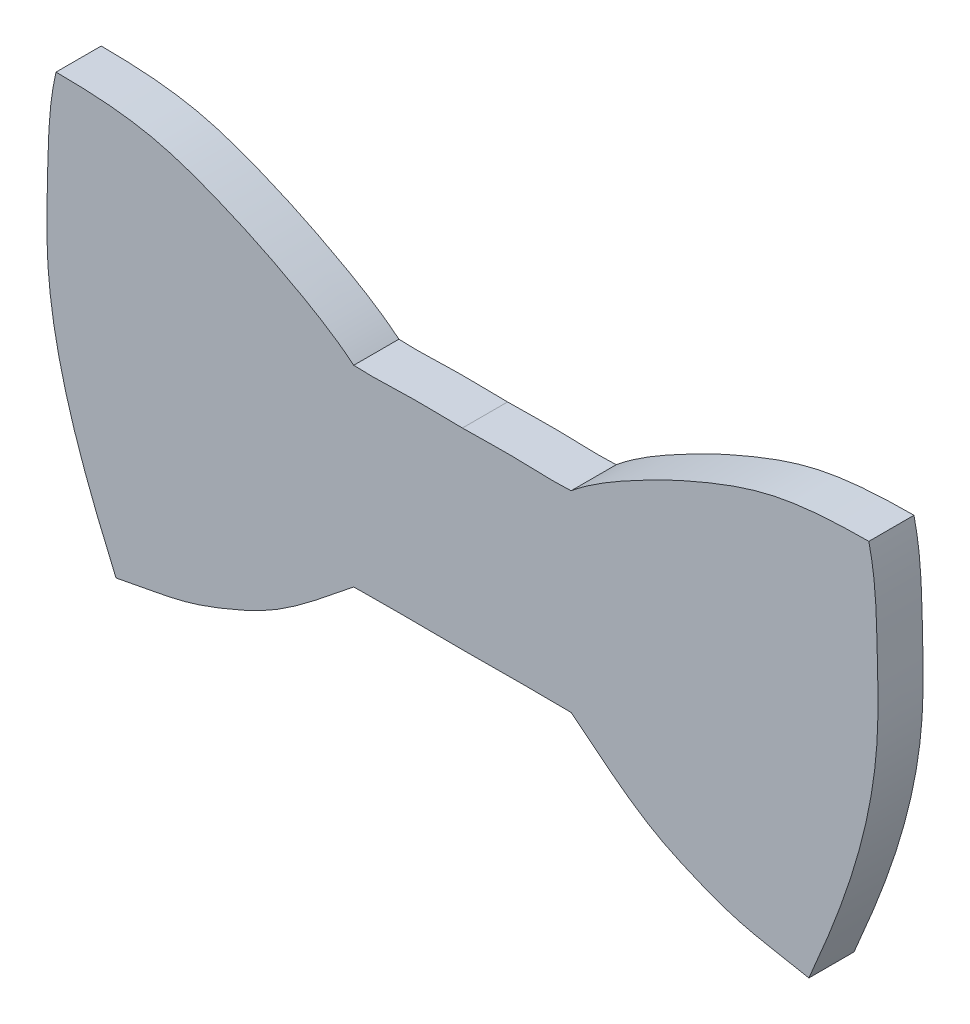
ISO-10303-21;
HEADER;
FILE_DESCRIPTION(('STEP AP214'),'2;1');
FILE_NAME('part.step','',(''),(''),'','','');
FILE_SCHEMA(('AUTOMOTIVE_DESIGN { 1 0 10303 214 1 1 1 1 }'));
ENDSEC;
DATA;
#1=APPLICATION_CONTEXT('core data for automotive mechanical design processes');
#2=APPLICATION_PROTOCOL_DEFINITION('international standard','automotive_design',2000,#1);
#3=PRODUCT_CONTEXT('',#1,'mechanical');
#4=PRODUCT('Part','Part','',(#3));
#5=PRODUCT_RELATED_PRODUCT_CATEGORY('part','',(#4));
#6=PRODUCT_DEFINITION_FORMATION('','',#4);
#7=PRODUCT_DEFINITION_CONTEXT('part definition',#1,'design');
#8=PRODUCT_DEFINITION('design','',#6,#7);
#9=PRODUCT_DEFINITION_SHAPE('','',#8);
#10=(LENGTH_UNIT() NAMED_UNIT(*) SI_UNIT(.MILLI.,.METRE.));
#11=(NAMED_UNIT(*) PLANE_ANGLE_UNIT() SI_UNIT($,.RADIAN.));
#12=(NAMED_UNIT(*) SI_UNIT($,.STERADIAN.) SOLID_ANGLE_UNIT());
#13=UNCERTAINTY_MEASURE_WITH_UNIT(LENGTH_MEASURE(1.E-05),#10,'distance_accuracy_value','');
#14=(GEOMETRIC_REPRESENTATION_CONTEXT(3) GLOBAL_UNCERTAINTY_ASSIGNED_CONTEXT((#13)) GLOBAL_UNIT_ASSIGNED_CONTEXT((#10,
#11,#12)) REPRESENTATION_CONTEXT('',''));
#15=CARTESIAN_POINT('',(0.,0.,0.));
#16=DIRECTION('',(0.,0.,1.));
#17=DIRECTION('',(1.,0.,0.));
#18=AXIS2_PLACEMENT_3D('',#15,#16,#17);
#19=CARTESIAN_POINT('',(24.3606471335325,-15.0706417914493,3.175));
#20=CARTESIAN_POINT('',(25.111702689009,-13.3274620289679,3.175));
#21=CARTESIAN_POINT('',(26.2471355408163,-10.6270344034975,3.175));
#22=CARTESIAN_POINT('',(27.8199413318146,-6.03024929173684,3.175));
#23=CARTESIAN_POINT('',(28.8130430807305,-1.97544076661635,3.175));
#24=CARTESIAN_POINT('',(29.2915538138562,2.64552295784824,3.175));
#25=CARTESIAN_POINT('',(29.133975742591,7.62051324818554,3.175));
#26=CARTESIAN_POINT('',(29.1021611344671,11.3974140749983,3.175));
#27=CARTESIAN_POINT('',(28.575,13.6266901406554,3.175));
#28=B_SPLINE_CURVE_WITH_KNOTS('',3,(#19,#20,#21,#22,#23,#24,#25,#26,#27),.UNSPECIFIED.,.F.,.F.,
(4,1,1,1,1,1,4),(0.,0.193162946602264,0.297732292846902,0.494126747040162,0.616266979913512,
0.769089248560844,1.),.UNSPECIFIED.);
#29=DIRECTION('',(0.,0.,-1.));
#30=VECTOR('',#29,1.);
#31=SURFACE_OF_LINEAR_EXTRUSION('',#28,#30);
#32=CARTESIAN_POINT('',(24.3606471335325,-15.0706417914493,0.));
#33=CARTESIAN_POINT('',(25.111702689009,-13.3274620289679,0.));
#34=CARTESIAN_POINT('',(26.2471355408163,-10.6270344034975,0.));
#35=CARTESIAN_POINT('',(27.8199413318146,-6.03024929173684,0.));
#36=CARTESIAN_POINT('',(28.8130430807305,-1.97544076661635,0.));
#37=CARTESIAN_POINT('',(29.2915538138562,2.64552295784824,0.));
#38=CARTESIAN_POINT('',(29.133975742591,7.62051324818554,0.));
#39=CARTESIAN_POINT('',(29.1021611344671,11.3974140749983,0.));
#40=CARTESIAN_POINT('',(28.575,13.6266901406554,0.));
#41=B_SPLINE_CURVE_WITH_KNOTS('',3,(#32,#33,#34,#35,#36,#37,#38,#39,#40),.UNSPECIFIED.,.F.,.F.,
(4,1,1,1,1,1,4),(0.,0.193162946602264,0.297732292846902,0.494126747040162,0.616266979913512,
0.769089248560844,1.),.UNSPECIFIED.);
#42=CARTESIAN_POINT('',(24.3606471335325,-15.0706417914493,0.));
#43=VERTEX_POINT('',#42);
#44=CARTESIAN_POINT('',(28.575,13.6266901406554,0.));
#45=VERTEX_POINT('',#44);
#46=EDGE_CURVE('E192',#43,#45,#41,.T.);
#47=ORIENTED_EDGE('',*,*,#46,.T.);
#48=DIRECTION('',(0.,0.,-1.));
#49=VECTOR('',#48,1.);
#50=CARTESIAN_POINT('',(28.575,13.6266901406554,3.175));
#51=LINE('',#50,#49);
#52=CARTESIAN_POINT('',(28.575,13.6266901406554,3.175));
#53=VERTEX_POINT('',#52);
#54=EDGE_CURVE('E11',#53,#45,#51,.T.);
#55=ORIENTED_EDGE('',*,*,#54,.F.);
#56=CARTESIAN_POINT('',(24.3606471335325,-15.0706417914493,3.175));
#57=VERTEX_POINT('',#56);
#58=EDGE_CURVE('E193',#57,#53,#28,.T.);
#59=ORIENTED_EDGE('',*,*,#58,.F.);
#60=DIRECTION('',(0.,0.,-1.));
#61=VECTOR('',#60,1.);
#62=CARTESIAN_POINT('',(24.3606471335325,-15.0706417914493,3.175));
#63=LINE('',#62,#61);
#64=EDGE_CURVE('E232',#57,#43,#63,.T.);
#65=ORIENTED_EDGE('',*,*,#64,.T.);
#66=EDGE_LOOP('',(#47,#55,#59,#65));
#67=FACE_BOUND('',#66,.T.);
#68=ADVANCED_FACE('F33',(#67),#31,.F.);
#69=CARTESIAN_POINT('',(28.575,13.6266901406554,3.175));
#70=CARTESIAN_POINT('',(26.1997795623887,13.6206102965224,3.175));
#71=CARTESIAN_POINT('',(22.1867192471791,13.42094197108,3.175));
#72=CARTESIAN_POINT('',(17.8321369028701,11.8042071096826,3.175));
#73=CARTESIAN_POINT('',(14.6461926994371,10.4307061995014,3.175));
#74=CARTESIAN_POINT('',(11.456721177727,8.80139346754985,3.175));
#75=CARTESIAN_POINT('',(8.937335741708,7.31127509752058,3.175));
#76=CARTESIAN_POINT('',(7.64166796088609,6.23947245477222,3.175));
#77=B_SPLINE_CURVE_WITH_KNOTS('',3,(#69,#70,#71,#72,#73,#74,#75,#76),.UNSPECIFIED.,.F.,.F.,(4,1,
1,1,1,4),(0.,0.316578467316281,0.52480259061082,0.612692342435153,0.777335836450638,1.),.UNSPECIFIED.);
#78=DIRECTION('',(0.,0.,-1.));
#79=VECTOR('',#78,1.);
#80=SURFACE_OF_LINEAR_EXTRUSION('',#77,#79);
#81=CARTESIAN_POINT('',(28.575,13.6266901406554,0.));
#82=CARTESIAN_POINT('',(26.1997795623887,13.6206102965224,0.));
#83=CARTESIAN_POINT('',(22.1867192471791,13.42094197108,0.));
#84=CARTESIAN_POINT('',(17.8321369028701,11.8042071096826,0.));
#85=CARTESIAN_POINT('',(14.6461926994371,10.4307061995014,0.));
#86=CARTESIAN_POINT('',(11.456721177727,8.80139346754985,0.));
#87=CARTESIAN_POINT('',(8.937335741708,7.31127509752058,0.));
#88=CARTESIAN_POINT('',(7.64166796088609,6.23947245477222,0.));
#89=B_SPLINE_CURVE_WITH_KNOTS('',3,(#81,#82,#83,#84,#85,#86,#87,#88),.UNSPECIFIED.,.F.,.F.,(4,1,
1,1,1,4),(0.,0.316578467316281,0.52480259061082,0.612692342435153,0.777335836450638,1.),.UNSPECIFIED.);
#90=CARTESIAN_POINT('',(7.64166796088609,6.23947245477222,0.));
#91=VERTEX_POINT('',#90);
#92=EDGE_CURVE('E240',#45,#91,#89,.T.);
#93=ORIENTED_EDGE('',*,*,#92,.T.);
#94=DIRECTION('',(0.,0.,-1.));
#95=VECTOR('',#94,1.);
#96=CARTESIAN_POINT('',(7.64166796088609,6.23947245477222,3.175));
#97=LINE('',#96,#95);
#98=CARTESIAN_POINT('',(7.64166796088609,6.23947245477222,3.175));
#99=VERTEX_POINT('',#98);
#100=EDGE_CURVE('E42',#99,#91,#97,.T.);
#101=ORIENTED_EDGE('',*,*,#100,.F.);
#102=EDGE_CURVE('E84',#53,#99,#77,.T.);
#103=ORIENTED_EDGE('',*,*,#102,.F.);
#104=ORIENTED_EDGE('',*,*,#54,.T.);
#105=EDGE_LOOP('',(#93,#101,#103,#104));
#106=FACE_BOUND('',#105,.T.);
#107=ADVANCED_FACE('F211',(#106),#80,.F.);
#108=CARTESIAN_POINT('',(7.64166796088609,6.23947245477222,3.175));
#109=CARTESIAN_POINT('',(6.17249147123753,6.15130005475315,3.175));
#110=CARTESIAN_POINT('',(3.62627655214371,6.35799266259703,3.175));
#111=CARTESIAN_POINT('',(1.07879148979533,6.22349708898131,3.175));
#112=CARTESIAN_POINT('',(0.,6.23947245477222,3.175));
#113=B_SPLINE_CURVE_WITH_KNOTS('',3,(#108,#109,#110,#111,#112),.UNSPECIFIED.,.F.,.F.,(4,1,4),
(0.,0.576548234003163,1.),.UNSPECIFIED.);
#114=DIRECTION('',(0.,0.,-1.));
#115=VECTOR('',#114,1.);
#116=SURFACE_OF_LINEAR_EXTRUSION('',#113,#115);
#117=CARTESIAN_POINT('',(7.64166796088609,6.23947245477222,0.));
#118=CARTESIAN_POINT('',(6.17249147123753,6.15130005475315,0.));
#119=CARTESIAN_POINT('',(3.62627655214371,6.35799266259703,0.));
#120=CARTESIAN_POINT('',(1.07879148979533,6.22349708898131,0.));
#121=CARTESIAN_POINT('',(0.,6.23947245477222,0.));
#122=B_SPLINE_CURVE_WITH_KNOTS('',3,(#117,#118,#119,#120,#121),.UNSPECIFIED.,.F.,.F.,(4,1,4),
(0.,0.576548234003163,1.),.UNSPECIFIED.);
#123=CARTESIAN_POINT('',(0.,6.23947245477222,0.));
#124=VERTEX_POINT('',#123);
#125=EDGE_CURVE('E247',#91,#124,#122,.T.);
#126=ORIENTED_EDGE('',*,*,#125,.T.);
#127=DIRECTION('',(0.,0.,-1.));
#128=VECTOR('',#127,1.);
#129=CARTESIAN_POINT('',(0.,6.23947245477222,3.175));
#130=LINE('',#129,#128);
#131=CARTESIAN_POINT('',(0.,6.23947245477222,3.175));
#132=VERTEX_POINT('',#131);
#133=EDGE_CURVE('E110',#132,#124,#130,.T.);
#134=ORIENTED_EDGE('',*,*,#133,.F.);
#135=EDGE_CURVE('E99',#99,#132,#113,.T.);
#136=ORIENTED_EDGE('',*,*,#135,.F.);
#137=ORIENTED_EDGE('',*,*,#100,.T.);
#138=EDGE_LOOP('',(#126,#134,#136,#137));
#139=FACE_BOUND('',#138,.T.);
#140=ADVANCED_FACE('F214',(#139),#116,.F.);
#141=CARTESIAN_POINT('',(0.,-7.26070221735517,3.175));
#142=CARTESIAN_POINT('',(1.07872206530469,-7.26554740949181,3.175));
#143=CARTESIAN_POINT('',(3.62582691954246,-7.22665019579035,3.175));
#144=CARTESIAN_POINT('',(6.1732245664439,-7.24434780995123,3.175));
#145=CARTESIAN_POINT('',(7.64166796088609,-7.26070221735517,3.175));
#146=B_SPLINE_CURVE_WITH_KNOTS('',3,(#141,#142,#143,#144,#145),.UNSPECIFIED.,.F.,.F.,(4,1,4),
(0.,0.423473588115042,1.),.UNSPECIFIED.);
#147=DIRECTION('',(0.,0.,-1.));
#148=VECTOR('',#147,1.);
#149=SURFACE_OF_LINEAR_EXTRUSION('',#146,#148);
#150=CARTESIAN_POINT('',(0.,-7.26070221735517,0.));
#151=CARTESIAN_POINT('',(1.07872206530469,-7.26554740949181,0.));
#152=CARTESIAN_POINT('',(3.62582691954246,-7.22665019579035,0.));
#153=CARTESIAN_POINT('',(6.1732245664439,-7.24434780995123,0.));
#154=CARTESIAN_POINT('',(7.64166796088609,-7.26070221735517,0.));
#155=B_SPLINE_CURVE_WITH_KNOTS('',3,(#150,#151,#152,#153,#154),.UNSPECIFIED.,.F.,.F.,(4,1,4),
(0.,0.423473588115042,1.),.UNSPECIFIED.);
#156=CARTESIAN_POINT('',(0.,-7.26070221735517,0.));
#157=VERTEX_POINT('',#156);
#158=CARTESIAN_POINT('',(7.64166796088609,-7.26070221735517,0.));
#159=VERTEX_POINT('',#158);
#160=EDGE_CURVE('E70',#157,#159,#155,.T.);
#161=ORIENTED_EDGE('',*,*,#160,.T.);
#162=DIRECTION('',(0.,0.,-1.));
#163=VECTOR('',#162,1.);
#164=CARTESIAN_POINT('',(7.64166796088609,-7.26070221735517,3.175));
#165=LINE('',#164,#163);
#166=CARTESIAN_POINT('',(7.64166796088609,-7.26070221735517,3.175));
#167=VERTEX_POINT('',#166);
#168=EDGE_CURVE('E97',#167,#159,#165,.T.);
#169=ORIENTED_EDGE('',*,*,#168,.F.);
#170=CARTESIAN_POINT('',(0.,-7.26070221735517,3.175));
#171=VERTEX_POINT('',#170);
#172=EDGE_CURVE('E93',#171,#167,#146,.T.);
#173=ORIENTED_EDGE('',*,*,#172,.F.);
#174=DIRECTION('',(0.,0.,-1.));
#175=VECTOR('',#174,1.);
#176=CARTESIAN_POINT('',(0.,-7.26070221735517,3.175));
#177=LINE('',#176,#175);
#178=EDGE_CURVE('E96',#171,#157,#177,.T.);
#179=ORIENTED_EDGE('',*,*,#178,.T.);
#180=EDGE_LOOP('',(#161,#169,#173,#179));
#181=FACE_BOUND('',#180,.T.);
#182=ADVANCED_FACE('F95',(#181),#149,.F.);
#183=CARTESIAN_POINT('',(7.64166796088609,-7.26070221735517,3.175));
#184=CARTESIAN_POINT('',(9.57992027849854,-8.78623834655389,3.175));
#185=CARTESIAN_POINT('',(12.2246684471656,-11.1263796114412,3.175));
#186=CARTESIAN_POINT('',(16.3732312729716,-13.0132208567381,3.175));
#187=CARTESIAN_POINT('',(19.9127795687925,-14.3622674586221,3.175));
#188=CARTESIAN_POINT('',(22.6950691809463,-14.7128462763114,3.175));
#189=CARTESIAN_POINT('',(24.3606471335325,-15.0706417914493,3.175));
#190=B_SPLINE_CURVE_WITH_KNOTS('',3,(#183,#184,#185,#186,#187,#188,#189),.UNSPECIFIED.,.F.,.F.,
(4,1,1,1,4),(0.,0.395867569640052,0.555599062404663,0.726725739127783,1.),.UNSPECIFIED.);
#191=DIRECTION('',(0.,0.,-1.));
#192=VECTOR('',#191,1.);
#193=SURFACE_OF_LINEAR_EXTRUSION('',#190,#192);
#194=CARTESIAN_POINT('',(7.64166796088609,-7.26070221735517,0.));
#195=CARTESIAN_POINT('',(9.57992027849854,-8.78623834655389,0.));
#196=CARTESIAN_POINT('',(12.2246684471656,-11.1263796114412,0.));
#197=CARTESIAN_POINT('',(16.3732312729716,-13.0132208567381,0.));
#198=CARTESIAN_POINT('',(19.9127795687925,-14.3622674586221,0.));
#199=CARTESIAN_POINT('',(22.6950691809463,-14.7128462763114,0.));
#200=CARTESIAN_POINT('',(24.3606471335325,-15.0706417914493,0.));
#201=B_SPLINE_CURVE_WITH_KNOTS('',3,(#194,#195,#196,#197,#198,#199,#200),.UNSPECIFIED.,.F.,.F.,
(4,1,1,1,4),(0.,0.395867569640052,0.555599062404663,0.726725739127783,1.),.UNSPECIFIED.);
#202=EDGE_CURVE('E76',#159,#43,#201,.T.);
#203=ORIENTED_EDGE('',*,*,#202,.T.);
#204=ORIENTED_EDGE('',*,*,#64,.F.);
#205=EDGE_CURVE('E50',#167,#57,#190,.T.);
#206=ORIENTED_EDGE('',*,*,#205,.F.);
#207=ORIENTED_EDGE('',*,*,#168,.T.);
#208=EDGE_LOOP('',(#203,#204,#206,#207));
#209=FACE_BOUND('',#208,.T.);
#210=ADVANCED_FACE('F220',(#209),#193,.F.);
#211=CARTESIAN_POINT('',(28.8524938933196,-1.0658612877925,3.175));
#212=DIRECTION('',(0.,0.,1.));
#213=DIRECTION('',(1.,0.,0.));
#214=AXIS2_PLACEMENT_3D('',#211,#212,#213);
#215=PLANE('',#214);
#216=ORIENTED_EDGE('',*,*,#58,.T.);
#217=ORIENTED_EDGE('',*,*,#102,.T.);
#218=ORIENTED_EDGE('',*,*,#135,.T.);
#219=CARTESIAN_POINT('',(-7.64166796088609,6.23947245477222,3.175));
#220=CARTESIAN_POINT('',(-6.17249147123753,6.15130005475315,3.175));
#221=CARTESIAN_POINT('',(-3.62627655214371,6.35799266259703,3.175));
#222=CARTESIAN_POINT('',(-1.07879148979533,6.22349708898131,3.175));
#223=CARTESIAN_POINT('',(0.,6.23947245477222,3.175));
#224=B_SPLINE_CURVE_WITH_KNOTS('',3,(#219,#220,#221,#222,#223),.UNSPECIFIED.,.F.,.F.,(4,1,4),
(0.,0.576548234003163,1.),.UNSPECIFIED.);
#225=CARTESIAN_POINT('',(-7.64166796088609,6.23947245477222,3.175));
#226=VERTEX_POINT('',#225);
#227=EDGE_CURVE('E117',#226,#132,#224,.T.);
#228=ORIENTED_EDGE('',*,*,#227,.F.);
#229=CARTESIAN_POINT('',(-28.575,13.6266901406554,3.175));
#230=CARTESIAN_POINT('',(-26.1997795623887,13.6206102965224,3.175));
#231=CARTESIAN_POINT('',(-22.1867192471791,13.42094197108,3.175));
#232=CARTESIAN_POINT('',(-17.8321369028701,11.8042071096826,3.175));
#233=CARTESIAN_POINT('',(-14.6461926994371,10.4307061995014,3.175));
#234=CARTESIAN_POINT('',(-11.456721177727,8.80139346754985,3.175));
#235=CARTESIAN_POINT('',(-8.937335741708,7.31127509752058,3.175));
#236=CARTESIAN_POINT('',(-7.64166796088609,6.23947245477222,3.175));
#237=B_SPLINE_CURVE_WITH_KNOTS('',3,(#229,#230,#231,#232,#233,#234,#235,#236),.UNSPECIFIED.,.F.,
.F.,(4,1,1,1,1,4),(0.,0.316578467316281,0.52480259061082,0.612692342435153,0.777335836450638,
1.),.UNSPECIFIED.);
#238=CARTESIAN_POINT('',(-28.575,13.6266901406554,3.175));
#239=VERTEX_POINT('',#238);
#240=EDGE_CURVE('E120',#239,#226,#237,.T.);
#241=ORIENTED_EDGE('',*,*,#240,.F.);
#242=CARTESIAN_POINT('',(-24.3606471335325,-15.0706417914493,3.175));
#243=CARTESIAN_POINT('',(-25.111702689009,-13.3274620289679,3.175));
#244=CARTESIAN_POINT('',(-26.2471355408163,-10.6270344034975,3.175));
#245=CARTESIAN_POINT('',(-27.8199413318146,-6.03024929173684,3.175));
#246=CARTESIAN_POINT('',(-28.8130430807305,-1.97544076661635,3.175));
#247=CARTESIAN_POINT('',(-29.2915538138562,2.64552295784824,3.175));
#248=CARTESIAN_POINT('',(-29.133975742591,7.62051324818554,3.175));
#249=CARTESIAN_POINT('',(-29.1021611344671,11.3974140749983,3.175));
#250=CARTESIAN_POINT('',(-28.575,13.6266901406554,3.175));
#251=B_SPLINE_CURVE_WITH_KNOTS('',3,(#242,#243,#244,#245,#246,#247,#248,#249,#250),
.UNSPECIFIED.,.F.,.F.,(4,1,1,1,1,1,4),(0.,0.193162946602264,0.297732292846902,0.494126747040162,
0.616266979913512,0.769089248560844,1.),.UNSPECIFIED.);
#252=CARTESIAN_POINT('',(-24.3606471335325,-15.0706417914493,3.175));
#253=VERTEX_POINT('',#252);
#254=EDGE_CURVE('E122',#253,#239,#251,.T.);
#255=ORIENTED_EDGE('',*,*,#254,.F.);
#256=CARTESIAN_POINT('',(-7.64166796088609,-7.26070221735517,3.175));
#257=CARTESIAN_POINT('',(-9.57992027849854,-8.78623834655389,3.175));
#258=CARTESIAN_POINT('',(-12.2246684471656,-11.1263796114412,3.175));
#259=CARTESIAN_POINT('',(-16.3732312729716,-13.0132208567381,3.175));
#260=CARTESIAN_POINT('',(-19.9127795687925,-14.3622674586221,3.175));
#261=CARTESIAN_POINT('',(-22.6950691809463,-14.7128462763114,3.175));
#262=CARTESIAN_POINT('',(-24.3606471335325,-15.0706417914493,3.175));
#263=B_SPLINE_CURVE_WITH_KNOTS('',3,(#256,#257,#258,#259,#260,#261,#262),.UNSPECIFIED.,.F.,.F.,
(4,1,1,1,4),(0.,0.395867569640052,0.555599062404663,0.726725739127783,1.),.UNSPECIFIED.);
#264=CARTESIAN_POINT('',(-7.64166796088609,-7.26070221735517,3.175));
#265=VERTEX_POINT('',#264);
#266=EDGE_CURVE('E116',#265,#253,#263,.T.);
#267=ORIENTED_EDGE('',*,*,#266,.F.);
#268=CARTESIAN_POINT('',(0.,-7.26070221735517,3.175));
#269=CARTESIAN_POINT('',(-1.07872206530469,-7.26554740949181,3.175));
#270=CARTESIAN_POINT('',(-3.62582691954246,-7.22665019579035,3.175));
#271=CARTESIAN_POINT('',(-6.1732245664439,-7.24434780995123,3.175));
#272=CARTESIAN_POINT('',(-7.64166796088609,-7.26070221735517,3.175));
#273=B_SPLINE_CURVE_WITH_KNOTS('',3,(#268,#269,#270,#271,#272),.UNSPECIFIED.,.F.,.F.,(4,1,4),
(0.,0.423473588115042,1.),.UNSPECIFIED.);
#274=EDGE_CURVE('E107',#171,#265,#273,.T.);
#275=ORIENTED_EDGE('',*,*,#274,.F.);
#276=ORIENTED_EDGE('',*,*,#172,.T.);
#277=ORIENTED_EDGE('',*,*,#205,.T.);
#278=EDGE_LOOP('',(#216,#217,#218,#228,#241,#255,#267,#275,#276,#277));
#279=FACE_BOUND('',#278,.T.);
#280=ADVANCED_FACE('F113',(#279),#215,.T.);
#281=CARTESIAN_POINT('',(28.8524938933196,-1.0658612877925,0.));
#282=DIRECTION('',(0.,0.,1.));
#283=DIRECTION('',(1.,0.,0.));
#284=AXIS2_PLACEMENT_3D('',#281,#282,#283);
#285=PLANE('',#284);
#286=ORIENTED_EDGE('',*,*,#46,.F.);
#287=ORIENTED_EDGE('',*,*,#202,.F.);
#288=ORIENTED_EDGE('',*,*,#160,.F.);
#289=CARTESIAN_POINT('',(0.,-7.26070221735517,0.));
#290=CARTESIAN_POINT('',(-1.07872206530469,-7.26554740949181,0.));
#291=CARTESIAN_POINT('',(-3.62582691954246,-7.22665019579035,0.));
#292=CARTESIAN_POINT('',(-6.1732245664439,-7.24434780995123,0.));
#293=CARTESIAN_POINT('',(-7.64166796088609,-7.26070221735517,0.));
#294=B_SPLINE_CURVE_WITH_KNOTS('',3,(#289,#290,#291,#292,#293),.UNSPECIFIED.,.F.,.F.,(4,1,4),
(0.,0.423473588115042,1.),.UNSPECIFIED.);
#295=CARTESIAN_POINT('',(-7.64166796088609,-7.26070221735517,0.));
#296=VERTEX_POINT('',#295);
#297=EDGE_CURVE('E109',#157,#296,#294,.T.);
#298=ORIENTED_EDGE('',*,*,#297,.T.);
#299=CARTESIAN_POINT('',(-7.64166796088609,-7.26070221735517,0.));
#300=CARTESIAN_POINT('',(-9.57992027849854,-8.78623834655389,0.));
#301=CARTESIAN_POINT('',(-12.2246684471656,-11.1263796114412,0.));
#302=CARTESIAN_POINT('',(-16.3732312729716,-13.0132208567381,0.));
#303=CARTESIAN_POINT('',(-19.9127795687925,-14.3622674586221,0.));
#304=CARTESIAN_POINT('',(-22.6950691809463,-14.7128462763114,0.));
#305=CARTESIAN_POINT('',(-24.3606471335325,-15.0706417914493,0.));
#306=B_SPLINE_CURVE_WITH_KNOTS('',3,(#299,#300,#301,#302,#303,#304,#305),.UNSPECIFIED.,.F.,.F.,
(4,1,1,1,4),(0.,0.395867569640052,0.555599062404663,0.726725739127783,1.),.UNSPECIFIED.);
#307=CARTESIAN_POINT('',(-24.3606471335325,-15.0706417914493,0.));
#308=VERTEX_POINT('',#307);
#309=EDGE_CURVE('E302',#296,#308,#306,.T.);
#310=ORIENTED_EDGE('',*,*,#309,.T.);
#311=CARTESIAN_POINT('',(-24.3606471335325,-15.0706417914493,0.));
#312=CARTESIAN_POINT('',(-25.111702689009,-13.3274620289679,0.));
#313=CARTESIAN_POINT('',(-26.2471355408163,-10.6270344034975,0.));
#314=CARTESIAN_POINT('',(-27.8199413318146,-6.03024929173684,0.));
#315=CARTESIAN_POINT('',(-28.8130430807305,-1.97544076661635,0.));
#316=CARTESIAN_POINT('',(-29.2915538138562,2.64552295784824,0.));
#317=CARTESIAN_POINT('',(-29.133975742591,7.62051324818554,0.));
#318=CARTESIAN_POINT('',(-29.1021611344671,11.3974140749983,0.));
#319=CARTESIAN_POINT('',(-28.575,13.6266901406554,0.));
#320=B_SPLINE_CURVE_WITH_KNOTS('',3,(#311,#312,#313,#314,#315,#316,#317,#318,#319),
.UNSPECIFIED.,.F.,.F.,(4,1,1,1,1,1,4),(0.,0.193162946602264,0.297732292846902,0.494126747040162,
0.616266979913512,0.769089248560844,1.),.UNSPECIFIED.);
#321=CARTESIAN_POINT('',(-28.575,13.6266901406554,0.));
#322=VERTEX_POINT('',#321);
#323=EDGE_CURVE('E299',#308,#322,#320,.T.);
#324=ORIENTED_EDGE('',*,*,#323,.T.);
#325=CARTESIAN_POINT('',(-28.575,13.6266901406554,0.));
#326=CARTESIAN_POINT('',(-26.1997795623887,13.6206102965224,0.));
#327=CARTESIAN_POINT('',(-22.1867192471791,13.42094197108,0.));
#328=CARTESIAN_POINT('',(-17.8321369028701,11.8042071096826,0.));
#329=CARTESIAN_POINT('',(-14.6461926994371,10.4307061995014,0.));
#330=CARTESIAN_POINT('',(-11.456721177727,8.80139346754985,0.));
#331=CARTESIAN_POINT('',(-8.937335741708,7.31127509752058,0.));
#332=CARTESIAN_POINT('',(-7.64166796088609,6.23947245477222,0.));
#333=B_SPLINE_CURVE_WITH_KNOTS('',3,(#325,#326,#327,#328,#329,#330,#331,#332),.UNSPECIFIED.,.F.,
.F.,(4,1,1,1,1,4),(0.,0.316578467316281,0.52480259061082,0.612692342435153,0.777335836450638,
1.),.UNSPECIFIED.);
#334=CARTESIAN_POINT('',(-7.64166796088609,6.23947245477222,0.));
#335=VERTEX_POINT('',#334);
#336=EDGE_CURVE('E158',#322,#335,#333,.T.);
#337=ORIENTED_EDGE('',*,*,#336,.T.);
#338=CARTESIAN_POINT('',(-7.64166796088609,6.23947245477222,0.));
#339=CARTESIAN_POINT('',(-6.17249147123753,6.15130005475315,0.));
#340=CARTESIAN_POINT('',(-3.62627655214371,6.35799266259703,0.));
#341=CARTESIAN_POINT('',(-1.07879148979533,6.22349708898131,0.));
#342=CARTESIAN_POINT('',(0.,6.23947245477222,0.));
#343=B_SPLINE_CURVE_WITH_KNOTS('',3,(#338,#339,#340,#341,#342),.UNSPECIFIED.,.F.,.F.,(4,1,4),
(0.,0.576548234003163,1.),.UNSPECIFIED.);
#344=EDGE_CURVE('E166',#335,#124,#343,.T.);
#345=ORIENTED_EDGE('',*,*,#344,.T.);
#346=ORIENTED_EDGE('',*,*,#125,.F.);
#347=ORIENTED_EDGE('',*,*,#92,.F.);
#348=EDGE_LOOP('',(#286,#287,#288,#298,#310,#324,#337,#345,#346,#347));
#349=FACE_BOUND('',#348,.T.);
#350=ADVANCED_FACE('F151',(#349),#285,.F.);
#351=DIRECTION('',(0.,0.,-1.));
#352=VECTOR('',#351,1.);
#353=SURFACE_OF_LINEAR_EXTRUSION('',#251,#352);
#354=ORIENTED_EDGE('',*,*,#323,.F.);
#355=DIRECTION('',(0.,0.,-1.));
#356=VECTOR('',#355,1.);
#357=CARTESIAN_POINT('',(-24.3606471335325,-15.0706417914493,3.175));
#358=LINE('',#357,#356);
#359=EDGE_CURVE('E190',#253,#308,#358,.T.);
#360=ORIENTED_EDGE('',*,*,#359,.F.);
#361=ORIENTED_EDGE('',*,*,#254,.T.);
#362=DIRECTION('',(0.,0.,-1.));
#363=VECTOR('',#362,1.);
#364=CARTESIAN_POINT('',(-28.575,13.6266901406554,3.175));
#365=LINE('',#364,#363);
#366=EDGE_CURVE('E180',#239,#322,#365,.T.);
#367=ORIENTED_EDGE('',*,*,#366,.T.);
#368=EDGE_LOOP('',(#354,#360,#361,#367));
#369=FACE_BOUND('',#368,.T.);
#370=ADVANCED_FACE('F147',(#369),#353,.T.);
#371=DIRECTION('',(0.,0.,-1.));
#372=VECTOR('',#371,1.);
#373=SURFACE_OF_LINEAR_EXTRUSION('',#263,#372);
#374=ORIENTED_EDGE('',*,*,#309,.F.);
#375=DIRECTION('',(0.,0.,-1.));
#376=VECTOR('',#375,1.);
#377=CARTESIAN_POINT('',(-7.64166796088609,-7.26070221735517,3.175));
#378=LINE('',#377,#376);
#379=EDGE_CURVE('E188',#265,#296,#378,.T.);
#380=ORIENTED_EDGE('',*,*,#379,.F.);
#381=ORIENTED_EDGE('',*,*,#266,.T.);
#382=ORIENTED_EDGE('',*,*,#359,.T.);
#383=EDGE_LOOP('',(#374,#380,#381,#382));
#384=FACE_BOUND('',#383,.T.);
#385=ADVANCED_FACE('F143',(#384),#373,.T.);
#386=DIRECTION('',(0.,0.,-1.));
#387=VECTOR('',#386,1.);
#388=SURFACE_OF_LINEAR_EXTRUSION('',#273,#387);
#389=ORIENTED_EDGE('',*,*,#297,.F.);
#390=ORIENTED_EDGE('',*,*,#178,.F.);
#391=ORIENTED_EDGE('',*,*,#274,.T.);
#392=ORIENTED_EDGE('',*,*,#379,.T.);
#393=EDGE_LOOP('',(#389,#390,#391,#392));
#394=FACE_BOUND('',#393,.T.);
#395=ADVANCED_FACE('F104',(#394),#388,.T.);
#396=DIRECTION('',(0.,0.,-1.));
#397=VECTOR('',#396,1.);
#398=SURFACE_OF_LINEAR_EXTRUSION('',#224,#397);
#399=ORIENTED_EDGE('',*,*,#344,.F.);
#400=DIRECTION('',(0.,0.,-1.));
#401=VECTOR('',#400,1.);
#402=CARTESIAN_POINT('',(-7.64166796088609,6.23947245477222,3.175));
#403=LINE('',#402,#401);
#404=EDGE_CURVE('E185',#226,#335,#403,.T.);
#405=ORIENTED_EDGE('',*,*,#404,.F.);
#406=ORIENTED_EDGE('',*,*,#227,.T.);
#407=ORIENTED_EDGE('',*,*,#133,.T.);
#408=EDGE_LOOP('',(#399,#405,#406,#407));
#409=FACE_BOUND('',#408,.T.);
#410=ADVANCED_FACE('F142',(#409),#398,.T.);
#411=DIRECTION('',(0.,0.,-1.));
#412=VECTOR('',#411,1.);
#413=SURFACE_OF_LINEAR_EXTRUSION('',#237,#412);
#414=ORIENTED_EDGE('',*,*,#336,.F.);
#415=ORIENTED_EDGE('',*,*,#366,.F.);
#416=ORIENTED_EDGE('',*,*,#240,.T.);
#417=ORIENTED_EDGE('',*,*,#404,.T.);
#418=EDGE_LOOP('',(#414,#415,#416,#417));
#419=FACE_BOUND('',#418,.T.);
#420=ADVANCED_FACE('F326',(#419),#413,.T.);
#421=CLOSED_SHELL('',(#68,#107,#140,#182,#210,#280,#350,#370,#385,#395,#410,#420));
#422=MANIFOLD_SOLID_BREP('B2',#421);
#423=ADVANCED_BREP_SHAPE_REPRESENTATION('',(#18,#422),#14);
#424=SHAPE_DEFINITION_REPRESENTATION(#9,#423);
ENDSEC;
END-ISO-10303-21;
